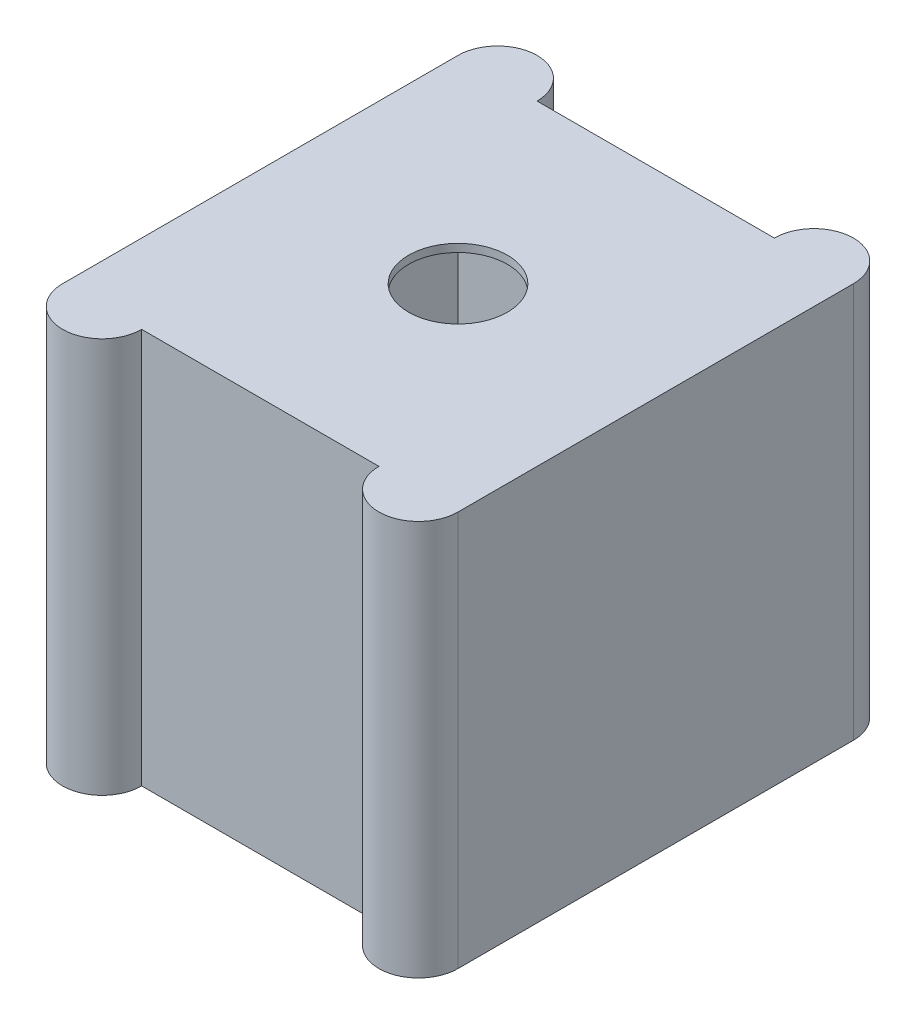
ISO-10303-21;
HEADER;
FILE_DESCRIPTION(('STEP AP214'),'2;1');
FILE_NAME('part.step','',(''),(''),'','','');
FILE_SCHEMA(('AUTOMOTIVE_DESIGN { 1 0 10303 214 1 1 1 1 }'));
ENDSEC;
DATA;
#1=APPLICATION_CONTEXT('core data for automotive mechanical design processes');
#2=APPLICATION_PROTOCOL_DEFINITION('international standard','automotive_design',2000,#1);
#3=PRODUCT_CONTEXT('',#1,'mechanical');
#4=PRODUCT('Part','Part','',(#3));
#5=PRODUCT_RELATED_PRODUCT_CATEGORY('part','',(#4));
#6=PRODUCT_DEFINITION_FORMATION('','',#4);
#7=PRODUCT_DEFINITION_CONTEXT('part definition',#1,'design');
#8=PRODUCT_DEFINITION('design','',#6,#7);
#9=PRODUCT_DEFINITION_SHAPE('','',#8);
#10=(LENGTH_UNIT() NAMED_UNIT(*) SI_UNIT(.MILLI.,.METRE.));
#11=(NAMED_UNIT(*) PLANE_ANGLE_UNIT() SI_UNIT($,.RADIAN.));
#12=(NAMED_UNIT(*) SI_UNIT($,.STERADIAN.) SOLID_ANGLE_UNIT());
#13=UNCERTAINTY_MEASURE_WITH_UNIT(LENGTH_MEASURE(1.E-05),#10,'distance_accuracy_value','');
#14=(GEOMETRIC_REPRESENTATION_CONTEXT(3) GLOBAL_UNCERTAINTY_ASSIGNED_CONTEXT((#13)) GLOBAL_UNIT_ASSIGNED_CONTEXT((#10,
#11,#12)) REPRESENTATION_CONTEXT('',''));
#15=CARTESIAN_POINT('',(0.,0.,0.));
#16=DIRECTION('',(0.,0.,1.));
#17=DIRECTION('',(1.,0.,0.));
#18=AXIS2_PLACEMENT_3D('',#15,#16,#17);
#19=CARTESIAN_POINT('',(40.,100.,50.));
#20=DIRECTION('',(0.,-1.,0.));
#21=DIRECTION('',(0.,0.,-1.));
#22=AXIS2_PLACEMENT_3D('',#19,#20,#21);
#23=PLANE('',#22);
#24=CARTESIAN_POINT('',(40.,100.,50.));
#25=DIRECTION('',(0.,1.,0.));
#26=DIRECTION('',(0.,0.,-1.));
#27=AXIS2_PLACEMENT_3D('',#24,#25,#26);
#28=CIRCLE('',#27,10.);
#29=CARTESIAN_POINT('',(30.,100.,50.));
#30=VERTEX_POINT('',#29);
#31=CARTESIAN_POINT('',(50.,100.,50.));
#32=VERTEX_POINT('',#31);
#33=EDGE_CURVE('E177',#30,#32,#28,.T.);
#34=ORIENTED_EDGE('',*,*,#33,.T.);
#35=DIRECTION('',(0.,0.,-1.));
#36=VECTOR('',#35,1.);
#37=CARTESIAN_POINT('',(50.,100.,-50.));
#38=LINE('',#37,#36);
#39=CARTESIAN_POINT('',(50.,100.,-50.));
#40=VERTEX_POINT('',#39);
#41=EDGE_CURVE('E106',#32,#40,#38,.T.);
#42=ORIENTED_EDGE('',*,*,#41,.T.);
#43=CARTESIAN_POINT('',(40.,100.,-50.));
#44=DIRECTION('',(0.,1.,0.));
#45=DIRECTION('',(0.,0.,1.));
#46=AXIS2_PLACEMENT_3D('',#43,#44,#45);
#47=CIRCLE('',#46,10.);
#48=CARTESIAN_POINT('',(30.,100.,-50.));
#49=VERTEX_POINT('',#48);
#50=EDGE_CURVE('E265',#40,#49,#47,.T.);
#51=ORIENTED_EDGE('',*,*,#50,.T.);
#52=DIRECTION('',(-1.,0.,0.));
#53=VECTOR('',#52,1.);
#54=CARTESIAN_POINT('',(-30.,100.,-50.));
#55=LINE('',#54,#53);
#56=CARTESIAN_POINT('',(-30.,100.,-50.));
#57=VERTEX_POINT('',#56);
#58=EDGE_CURVE('E268',#49,#57,#55,.T.);
#59=ORIENTED_EDGE('',*,*,#58,.T.);
#60=CARTESIAN_POINT('',(-40.,100.,-50.));
#61=DIRECTION('',(0.,1.,0.));
#62=DIRECTION('',(0.,0.,-1.));
#63=AXIS2_PLACEMENT_3D('',#60,#61,#62);
#64=CIRCLE('',#63,10.);
#65=CARTESIAN_POINT('',(-50.,100.,-50.));
#66=VERTEX_POINT('',#65);
#67=EDGE_CURVE('E128',#57,#66,#64,.T.);
#68=ORIENTED_EDGE('',*,*,#67,.T.);
#69=DIRECTION('',(0.,0.,1.));
#70=VECTOR('',#69,1.);
#71=CARTESIAN_POINT('',(-50.,100.,-50.));
#72=LINE('',#71,#70);
#73=CARTESIAN_POINT('',(-50.,100.,50.));
#74=VERTEX_POINT('',#73);
#75=EDGE_CURVE('E121',#66,#74,#72,.T.);
#76=ORIENTED_EDGE('',*,*,#75,.T.);
#77=CARTESIAN_POINT('',(-40.,100.,50.));
#78=DIRECTION('',(0.,1.,0.));
#79=DIRECTION('',(0.,0.,1.));
#80=AXIS2_PLACEMENT_3D('',#77,#78,#79);
#81=CIRCLE('',#80,10.);
#82=CARTESIAN_POINT('',(-30.,100.,50.));
#83=VERTEX_POINT('',#82);
#84=EDGE_CURVE('E125',#74,#83,#81,.T.);
#85=ORIENTED_EDGE('',*,*,#84,.T.);
#86=DIRECTION('',(1.,0.,0.));
#87=VECTOR('',#86,1.);
#88=CARTESIAN_POINT('',(-30.,100.,50.));
#89=LINE('',#88,#87);
#90=EDGE_CURVE('E64',#83,#30,#89,.T.);
#91=ORIENTED_EDGE('',*,*,#90,.T.);
#92=EDGE_LOOP('',(#34,#42,#51,#59,#68,#76,#85,#91));
#93=FACE_BOUND('',#92,.T.);
#94=CARTESIAN_POINT('',(0.,100.,0.));
#95=DIRECTION('',(0.,1.,0.));
#96=DIRECTION('',(0.,0.,1.));
#97=AXIS2_PLACEMENT_3D('',#94,#95,#96);
#98=CIRCLE('',#97,12.5);
#99=CARTESIAN_POINT('',(0.,100.,12.5));
#100=VERTEX_POINT('',#99);
#101=EDGE_CURVE('E158',#100,#100,#98,.T.);
#102=ORIENTED_EDGE('',*,*,#101,.F.);
#103=EDGE_LOOP('',(#102));
#104=FACE_BOUND('',#103,.T.);
#105=ADVANCED_FACE('F39',(#93,#104),#23,.F.);
#106=CARTESIAN_POINT('',(40.,0.,50.));
#107=DIRECTION('',(0.,-1.,0.));
#108=DIRECTION('',(0.,0.,-1.));
#109=AXIS2_PLACEMENT_3D('',#106,#107,#108);
#110=PLANE('',#109);
#111=DIRECTION('',(0.,0.,1.));
#112=VECTOR('',#111,1.);
#113=CARTESIAN_POINT('',(48.,0.,50.));
#114=LINE('',#113,#112);
#115=CARTESIAN_POINT('',(48.,0.,-48.));
#116=VERTEX_POINT('',#115);
#117=CARTESIAN_POINT('',(48.,0.,48.));
#118=VERTEX_POINT('',#117);
#119=EDGE_CURVE('E11',#116,#118,#114,.T.);
#120=ORIENTED_EDGE('',*,*,#119,.F.);
#121=DIRECTION('',(1.,0.,0.));
#122=VECTOR('',#121,1.);
#123=CARTESIAN_POINT('',(40.,0.,-48.));
#124=LINE('',#123,#122);
#125=CARTESIAN_POINT('',(-48.,0.,-48.));
#126=VERTEX_POINT('',#125);
#127=EDGE_CURVE('E199',#126,#116,#124,.T.);
#128=ORIENTED_EDGE('',*,*,#127,.F.);
#129=DIRECTION('',(0.,0.,-1.));
#130=VECTOR('',#129,1.);
#131=CARTESIAN_POINT('',(-48.,0.,50.));
#132=LINE('',#131,#130);
#133=CARTESIAN_POINT('',(-48.,0.,48.));
#134=VERTEX_POINT('',#133);
#135=EDGE_CURVE('E207',#134,#126,#132,.T.);
#136=ORIENTED_EDGE('',*,*,#135,.F.);
#137=DIRECTION('',(-1.,0.,0.));
#138=VECTOR('',#137,1.);
#139=CARTESIAN_POINT('',(40.,0.,48.));
#140=LINE('',#139,#138);
#141=EDGE_CURVE('E48',#118,#134,#140,.T.);
#142=ORIENTED_EDGE('',*,*,#141,.F.);
#143=EDGE_LOOP('',(#120,#128,#136,#142));
#144=FACE_BOUND('',#143,.T.);
#145=CARTESIAN_POINT('',(40.,0.,50.));
#146=DIRECTION('',(0.,1.,0.));
#147=DIRECTION('',(0.,0.,-1.));
#148=AXIS2_PLACEMENT_3D('',#145,#146,#147);
#149=CIRCLE('',#148,10.);
#150=CARTESIAN_POINT('',(30.,0.,50.));
#151=VERTEX_POINT('',#150);
#152=CARTESIAN_POINT('',(50.,0.,50.));
#153=VERTEX_POINT('',#152);
#154=EDGE_CURVE('E153',#151,#153,#149,.T.);
#155=ORIENTED_EDGE('',*,*,#154,.F.);
#156=DIRECTION('',(1.,0.,0.));
#157=VECTOR('',#156,1.);
#158=CARTESIAN_POINT('',(-30.,0.,50.));
#159=LINE('',#158,#157);
#160=CARTESIAN_POINT('',(-30.,0.,50.));
#161=VERTEX_POINT('',#160);
#162=EDGE_CURVE('E97',#161,#151,#159,.T.);
#163=ORIENTED_EDGE('',*,*,#162,.F.);
#164=CARTESIAN_POINT('',(-40.,0.,50.));
#165=DIRECTION('',(0.,1.,0.));
#166=DIRECTION('',(0.,0.,1.));
#167=AXIS2_PLACEMENT_3D('',#164,#165,#166);
#168=CIRCLE('',#167,10.);
#169=CARTESIAN_POINT('',(-50.,0.,50.));
#170=VERTEX_POINT('',#169);
#171=EDGE_CURVE('E172',#170,#161,#168,.T.);
#172=ORIENTED_EDGE('',*,*,#171,.F.);
#173=DIRECTION('',(0.,0.,1.));
#174=VECTOR('',#173,1.);
#175=CARTESIAN_POINT('',(-50.,0.,-50.));
#176=LINE('',#175,#174);
#177=CARTESIAN_POINT('',(-50.,0.,-50.));
#178=VERTEX_POINT('',#177);
#179=EDGE_CURVE('E138',#178,#170,#176,.T.);
#180=ORIENTED_EDGE('',*,*,#179,.F.);
#181=CARTESIAN_POINT('',(-40.,0.,-50.));
#182=DIRECTION('',(0.,1.,0.));
#183=DIRECTION('',(0.,0.,-1.));
#184=AXIS2_PLACEMENT_3D('',#181,#182,#183);
#185=CIRCLE('',#184,10.);
#186=CARTESIAN_POINT('',(-30.,0.,-50.));
#187=VERTEX_POINT('',#186);
#188=EDGE_CURVE('E167',#187,#178,#185,.T.);
#189=ORIENTED_EDGE('',*,*,#188,.F.);
#190=DIRECTION('',(-1.,0.,0.));
#191=VECTOR('',#190,1.);
#192=CARTESIAN_POINT('',(-30.,0.,-50.));
#193=LINE('',#192,#191);
#194=CARTESIAN_POINT('',(30.,0.,-50.));
#195=VERTEX_POINT('',#194);
#196=EDGE_CURVE('E164',#195,#187,#193,.T.);
#197=ORIENTED_EDGE('',*,*,#196,.F.);
#198=CARTESIAN_POINT('',(40.,0.,-50.));
#199=DIRECTION('',(0.,1.,0.));
#200=DIRECTION('',(0.,0.,1.));
#201=AXIS2_PLACEMENT_3D('',#198,#199,#200);
#202=CIRCLE('',#201,10.);
#203=CARTESIAN_POINT('',(50.,0.,-50.));
#204=VERTEX_POINT('',#203);
#205=EDGE_CURVE('E161',#204,#195,#202,.T.);
#206=ORIENTED_EDGE('',*,*,#205,.F.);
#207=DIRECTION('',(0.,0.,-1.));
#208=VECTOR('',#207,1.);
#209=CARTESIAN_POINT('',(50.,0.,-50.));
#210=LINE('',#209,#208);
#211=EDGE_CURVE('E157',#153,#204,#210,.T.);
#212=ORIENTED_EDGE('',*,*,#211,.F.);
#213=EDGE_LOOP('',(#155,#163,#172,#180,#189,#197,#206,#212));
#214=FACE_BOUND('',#213,.T.);
#215=ADVANCED_FACE('F235',(#144,#214),#110,.T.);
#216=CARTESIAN_POINT('',(40.,100.,50.));
#217=DIRECTION('',(0.,-1.,0.));
#218=DIRECTION('',(0.,0.,-1.));
#219=AXIS2_PLACEMENT_3D('',#216,#217,#218);
#220=CYLINDRICAL_SURFACE('',#219,10.);
#221=ORIENTED_EDGE('',*,*,#154,.T.);
#222=DIRECTION('',(0.,-1.,0.));
#223=VECTOR('',#222,1.);
#224=CARTESIAN_POINT('',(50.,100.,50.));
#225=LINE('',#224,#223);
#226=EDGE_CURVE('E196',#32,#153,#225,.T.);
#227=ORIENTED_EDGE('',*,*,#226,.F.);
#228=ORIENTED_EDGE('',*,*,#33,.F.);
#229=DIRECTION('',(0.,-1.,0.));
#230=VECTOR('',#229,1.);
#231=CARTESIAN_POINT('',(30.,100.,50.));
#232=LINE('',#231,#230);
#233=EDGE_CURVE('E149',#30,#151,#232,.T.);
#234=ORIENTED_EDGE('',*,*,#233,.T.);
#235=EDGE_LOOP('',(#221,#227,#228,#234));
#236=FACE_BOUND('',#235,.T.);
#237=ADVANCED_FACE('F41',(#236),#220,.T.);
#238=CARTESIAN_POINT('',(50.,100.,-50.));
#239=DIRECTION('',(-1.,0.,0.));
#240=DIRECTION('',(0.,0.,1.));
#241=AXIS2_PLACEMENT_3D('',#238,#239,#240);
#242=PLANE('',#241);
#243=ORIENTED_EDGE('',*,*,#211,.T.);
#244=DIRECTION('',(0.,-1.,0.));
#245=VECTOR('',#244,1.);
#246=CARTESIAN_POINT('',(50.,100.,-50.));
#247=LINE('',#246,#245);
#248=EDGE_CURVE('E192',#40,#204,#247,.T.);
#249=ORIENTED_EDGE('',*,*,#248,.F.);
#250=ORIENTED_EDGE('',*,*,#41,.F.);
#251=ORIENTED_EDGE('',*,*,#226,.T.);
#252=EDGE_LOOP('',(#243,#249,#250,#251));
#253=FACE_BOUND('',#252,.T.);
#254=ADVANCED_FACE('F322',(#253),#242,.F.);
#255=CARTESIAN_POINT('',(40.,100.,-50.));
#256=DIRECTION('',(0.,-1.,0.));
#257=DIRECTION('',(0.,0.,-1.));
#258=AXIS2_PLACEMENT_3D('',#255,#256,#257);
#259=CYLINDRICAL_SURFACE('',#258,10.);
#260=ORIENTED_EDGE('',*,*,#205,.T.);
#261=DIRECTION('',(0.,-1.,0.));
#262=VECTOR('',#261,1.);
#263=CARTESIAN_POINT('',(30.,100.,-50.));
#264=LINE('',#263,#262);
#265=EDGE_CURVE('E188',#49,#195,#264,.T.);
#266=ORIENTED_EDGE('',*,*,#265,.F.);
#267=ORIENTED_EDGE('',*,*,#50,.F.);
#268=ORIENTED_EDGE('',*,*,#248,.T.);
#269=EDGE_LOOP('',(#260,#266,#267,#268));
#270=FACE_BOUND('',#269,.T.);
#271=ADVANCED_FACE('F319',(#270),#259,.T.);
#272=CARTESIAN_POINT('',(-30.,100.,-50.));
#273=DIRECTION('',(0.,0.,1.));
#274=DIRECTION('',(1.,0.,0.));
#275=AXIS2_PLACEMENT_3D('',#272,#273,#274);
#276=PLANE('',#275);
#277=ORIENTED_EDGE('',*,*,#196,.T.);
#278=DIRECTION('',(0.,-1.,0.));
#279=VECTOR('',#278,1.);
#280=CARTESIAN_POINT('',(-30.,100.,-50.));
#281=LINE('',#280,#279);
#282=EDGE_CURVE('E184',#57,#187,#281,.T.);
#283=ORIENTED_EDGE('',*,*,#282,.F.);
#284=ORIENTED_EDGE('',*,*,#58,.F.);
#285=ORIENTED_EDGE('',*,*,#265,.T.);
#286=EDGE_LOOP('',(#277,#283,#284,#285));
#287=FACE_BOUND('',#286,.T.);
#288=ADVANCED_FACE('F315',(#287),#276,.F.);
#289=CARTESIAN_POINT('',(-40.,100.,-50.));
#290=DIRECTION('',(0.,-1.,0.));
#291=DIRECTION('',(0.,0.,-1.));
#292=AXIS2_PLACEMENT_3D('',#289,#290,#291);
#293=CYLINDRICAL_SURFACE('',#292,10.);
#294=ORIENTED_EDGE('',*,*,#188,.T.);
#295=DIRECTION('',(0.,-1.,0.));
#296=VECTOR('',#295,1.);
#297=CARTESIAN_POINT('',(-50.,100.,-50.));
#298=LINE('',#297,#296);
#299=EDGE_CURVE('E142',#66,#178,#298,.T.);
#300=ORIENTED_EDGE('',*,*,#299,.F.);
#301=ORIENTED_EDGE('',*,*,#67,.F.);
#302=ORIENTED_EDGE('',*,*,#282,.T.);
#303=EDGE_LOOP('',(#294,#300,#301,#302));
#304=FACE_BOUND('',#303,.T.);
#305=ADVANCED_FACE('F312',(#304),#293,.T.);
#306=CARTESIAN_POINT('',(-50.,100.,-50.));
#307=DIRECTION('',(1.,0.,0.));
#308=DIRECTION('',(0.,0.,-1.));
#309=AXIS2_PLACEMENT_3D('',#306,#307,#308);
#310=PLANE('',#309);
#311=ORIENTED_EDGE('',*,*,#179,.T.);
#312=DIRECTION('',(0.,-1.,0.));
#313=VECTOR('',#312,1.);
#314=CARTESIAN_POINT('',(-50.,100.,50.));
#315=LINE('',#314,#313);
#316=EDGE_CURVE('E135',#74,#170,#315,.T.);
#317=ORIENTED_EDGE('',*,*,#316,.F.);
#318=ORIENTED_EDGE('',*,*,#75,.F.);
#319=ORIENTED_EDGE('',*,*,#299,.T.);
#320=EDGE_LOOP('',(#311,#317,#318,#319));
#321=FACE_BOUND('',#320,.T.);
#322=ADVANCED_FACE('F136',(#321),#310,.F.);
#323=CARTESIAN_POINT('',(-40.,100.,50.));
#324=DIRECTION('',(0.,-1.,0.));
#325=DIRECTION('',(0.,0.,-1.));
#326=AXIS2_PLACEMENT_3D('',#323,#324,#325);
#327=CYLINDRICAL_SURFACE('',#326,10.);
#328=ORIENTED_EDGE('',*,*,#171,.T.);
#329=DIRECTION('',(0.,-1.,0.));
#330=VECTOR('',#329,1.);
#331=CARTESIAN_POINT('',(-30.,100.,50.));
#332=LINE('',#331,#330);
#333=EDGE_CURVE('E143',#83,#161,#332,.T.);
#334=ORIENTED_EDGE('',*,*,#333,.F.);
#335=ORIENTED_EDGE('',*,*,#84,.F.);
#336=ORIENTED_EDGE('',*,*,#316,.T.);
#337=EDGE_LOOP('',(#328,#334,#335,#336));
#338=FACE_BOUND('',#337,.T.);
#339=ADVANCED_FACE('F145',(#338),#327,.T.);
#340=CARTESIAN_POINT('',(-30.,100.,50.));
#341=DIRECTION('',(0.,0.,-1.));
#342=DIRECTION('',(-1.,0.,0.));
#343=AXIS2_PLACEMENT_3D('',#340,#341,#342);
#344=PLANE('',#343);
#345=ORIENTED_EDGE('',*,*,#162,.T.);
#346=ORIENTED_EDGE('',*,*,#233,.F.);
#347=ORIENTED_EDGE('',*,*,#90,.F.);
#348=ORIENTED_EDGE('',*,*,#333,.T.);
#349=EDGE_LOOP('',(#345,#346,#347,#348));
#350=FACE_BOUND('',#349,.T.);
#351=ADVANCED_FACE('F305',(#350),#344,.F.);
#352=CARTESIAN_POINT('',(0.,100.,0.));
#353=DIRECTION('',(0.,-1.,0.));
#354=DIRECTION('',(0.,0.,-1.));
#355=AXIS2_PLACEMENT_3D('',#352,#353,#354);
#356=CYLINDRICAL_SURFACE('',#355,12.5);
#357=CARTESIAN_POINT('',(0.,98.,0.));
#358=DIRECTION('',(0.,1.,0.));
#359=DIRECTION('',(0.,0.,1.));
#360=AXIS2_PLACEMENT_3D('',#357,#358,#359);
#361=CIRCLE('',#360,12.5);
#362=CARTESIAN_POINT('',(0.,98.,12.5));
#363=VERTEX_POINT('',#362);
#364=EDGE_CURVE('E200',#363,#363,#361,.T.);
#365=ORIENTED_EDGE('',*,*,#364,.F.);
#366=EDGE_LOOP('',(#365));
#367=FACE_BOUND('',#366,.T.);
#368=ORIENTED_EDGE('',*,*,#101,.T.);
#369=EDGE_LOOP('',(#368));
#370=FACE_BOUND('',#369,.T.);
#371=ADVANCED_FACE('F302',(#367,#370),#356,.F.);
#372=CARTESIAN_POINT('',(48.,-52.,-48.));
#373=DIRECTION('',(1.,0.,0.));
#374=DIRECTION('',(0.,0.,-1.));
#375=AXIS2_PLACEMENT_3D('',#372,#373,#374);
#376=PLANE('',#375);
#377=ORIENTED_EDGE('',*,*,#119,.T.);
#378=DIRECTION('',(0.,1.,0.));
#379=VECTOR('',#378,1.);
#380=CARTESIAN_POINT('',(48.,-52.,48.));
#381=LINE('',#380,#379);
#382=CARTESIAN_POINT('',(48.,98.,48.));
#383=VERTEX_POINT('',#382);
#384=EDGE_CURVE('E204',#118,#383,#381,.T.);
#385=ORIENTED_EDGE('',*,*,#384,.T.);
#386=DIRECTION('',(0.,0.,-1.));
#387=VECTOR('',#386,1.);
#388=CARTESIAN_POINT('',(48.,98.,-48.));
#389=LINE('',#388,#387);
#390=CARTESIAN_POINT('',(48.,98.,-48.));
#391=VERTEX_POINT('',#390);
#392=EDGE_CURVE('E249',#383,#391,#389,.T.);
#393=ORIENTED_EDGE('',*,*,#392,.T.);
#394=DIRECTION('',(0.,1.,0.));
#395=VECTOR('',#394,1.);
#396=CARTESIAN_POINT('',(48.,-52.,-48.));
#397=LINE('',#396,#395);
#398=EDGE_CURVE('E241',#116,#391,#397,.T.);
#399=ORIENTED_EDGE('',*,*,#398,.F.);
#400=EDGE_LOOP('',(#377,#385,#393,#399));
#401=FACE_BOUND('',#400,.T.);
#402=ADVANCED_FACE('F247',(#401),#376,.F.);
#403=CARTESIAN_POINT('',(-48.,-52.,48.));
#404=DIRECTION('',(0.,0.,1.));
#405=DIRECTION('',(1.,0.,0.));
#406=AXIS2_PLACEMENT_3D('',#403,#404,#405);
#407=PLANE('',#406);
#408=ORIENTED_EDGE('',*,*,#141,.T.);
#409=DIRECTION('',(0.,1.,0.));
#410=VECTOR('',#409,1.);
#411=CARTESIAN_POINT('',(-48.,-52.,48.));
#412=LINE('',#411,#410);
#413=CARTESIAN_POINT('',(-48.,98.,48.));
#414=VERTEX_POINT('',#413);
#415=EDGE_CURVE('E220',#134,#414,#412,.T.);
#416=ORIENTED_EDGE('',*,*,#415,.T.);
#417=DIRECTION('',(1.,0.,0.));
#418=VECTOR('',#417,1.);
#419=CARTESIAN_POINT('',(-48.,98.,48.));
#420=LINE('',#419,#418);
#421=EDGE_CURVE('E251',#414,#383,#420,.T.);
#422=ORIENTED_EDGE('',*,*,#421,.T.);
#423=ORIENTED_EDGE('',*,*,#384,.F.);
#424=EDGE_LOOP('',(#408,#416,#422,#423));
#425=FACE_BOUND('',#424,.T.);
#426=ADVANCED_FACE('F217',(#425),#407,.F.);
#427=CARTESIAN_POINT('',(-48.,-52.,-48.));
#428=DIRECTION('',(-1.,0.,0.));
#429=DIRECTION('',(0.,0.,1.));
#430=AXIS2_PLACEMENT_3D('',#427,#428,#429);
#431=PLANE('',#430);
#432=ORIENTED_EDGE('',*,*,#135,.T.);
#433=DIRECTION('',(0.,1.,0.));
#434=VECTOR('',#433,1.);
#435=CARTESIAN_POINT('',(-48.,-52.,-48.));
#436=LINE('',#435,#434);
#437=CARTESIAN_POINT('',(-48.,98.,-48.));
#438=VERTEX_POINT('',#437);
#439=EDGE_CURVE('E55',#126,#438,#436,.T.);
#440=ORIENTED_EDGE('',*,*,#439,.T.);
#441=DIRECTION('',(0.,0.,1.));
#442=VECTOR('',#441,1.);
#443=CARTESIAN_POINT('',(-48.,98.,-48.));
#444=LINE('',#443,#442);
#445=EDGE_CURVE('E231',#438,#414,#444,.T.);
#446=ORIENTED_EDGE('',*,*,#445,.T.);
#447=ORIENTED_EDGE('',*,*,#415,.F.);
#448=EDGE_LOOP('',(#432,#440,#446,#447));
#449=FACE_BOUND('',#448,.T.);
#450=ADVANCED_FACE('F228',(#449),#431,.F.);
#451=CARTESIAN_POINT('',(-48.,-52.,-48.));
#452=DIRECTION('',(0.,0.,-1.));
#453=DIRECTION('',(-1.,0.,0.));
#454=AXIS2_PLACEMENT_3D('',#451,#452,#453);
#455=PLANE('',#454);
#456=ORIENTED_EDGE('',*,*,#127,.T.);
#457=ORIENTED_EDGE('',*,*,#398,.T.);
#458=DIRECTION('',(-1.,0.,0.));
#459=VECTOR('',#458,1.);
#460=CARTESIAN_POINT('',(-48.,98.,-48.));
#461=LINE('',#460,#459);
#462=EDGE_CURVE('E276',#391,#438,#461,.T.);
#463=ORIENTED_EDGE('',*,*,#462,.T.);
#464=ORIENTED_EDGE('',*,*,#439,.F.);
#465=EDGE_LOOP('',(#456,#457,#463,#464));
#466=FACE_BOUND('',#465,.T.);
#467=ADVANCED_FACE('F239',(#466),#455,.F.);
#468=CARTESIAN_POINT('',(0.,98.,0.));
#469=DIRECTION('',(0.,1.,0.));
#470=DIRECTION('',(0.,0.,1.));
#471=AXIS2_PLACEMENT_3D('',#468,#469,#470);
#472=PLANE('',#471);
#473=ORIENTED_EDGE('',*,*,#364,.T.);
#474=EDGE_LOOP('',(#473));
#475=FACE_BOUND('',#474,.T.);
#476=ORIENTED_EDGE('',*,*,#392,.F.);
#477=ORIENTED_EDGE('',*,*,#421,.F.);
#478=ORIENTED_EDGE('',*,*,#445,.F.);
#479=ORIENTED_EDGE('',*,*,#462,.F.);
#480=EDGE_LOOP('',(#476,#477,#478,#479));
#481=FACE_BOUND('',#480,.T.);
#482=ADVANCED_FACE('F283',(#475,#481),#472,.F.);
#483=CLOSED_SHELL('',(#105,#215,#237,#254,#271,#288,#305,#322,#339,#351,#371,#402,#426,#450,
#467,#482));
#484=MANIFOLD_SOLID_BREP('B2',#483);
#485=ADVANCED_BREP_SHAPE_REPRESENTATION('',(#18,#484),#14);
#486=SHAPE_DEFINITION_REPRESENTATION(#9,#485);
ENDSEC;
END-ISO-10303-21;
